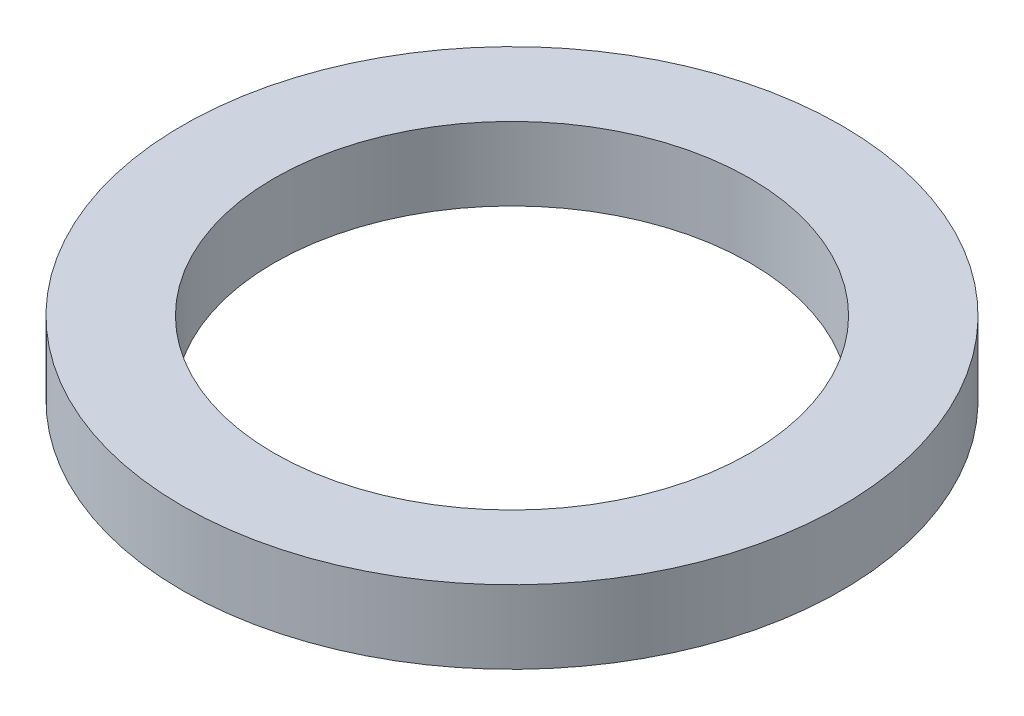
ISO-10303-21;
HEADER;
FILE_DESCRIPTION(('STEP AP214'),'2;1');
FILE_NAME('part.step','',(''),(''),'','','');
FILE_SCHEMA(('AUTOMOTIVE_DESIGN { 1 0 10303 214 1 1 1 1 }'));
ENDSEC;
DATA;
#1=APPLICATION_CONTEXT('core data for automotive mechanical design processes');
#2=APPLICATION_PROTOCOL_DEFINITION('international standard','automotive_design',2000,#1);
#3=PRODUCT_CONTEXT('',#1,'mechanical');
#4=PRODUCT('Part','Part','',(#3));
#5=PRODUCT_RELATED_PRODUCT_CATEGORY('part','',(#4));
#6=PRODUCT_DEFINITION_FORMATION('','',#4);
#7=PRODUCT_DEFINITION_CONTEXT('part definition',#1,'design');
#8=PRODUCT_DEFINITION('design','',#6,#7);
#9=PRODUCT_DEFINITION_SHAPE('','',#8);
#10=(LENGTH_UNIT() NAMED_UNIT(*) SI_UNIT(.MILLI.,.METRE.));
#11=(NAMED_UNIT(*) PLANE_ANGLE_UNIT() SI_UNIT($,.RADIAN.));
#12=(NAMED_UNIT(*) SI_UNIT($,.STERADIAN.) SOLID_ANGLE_UNIT());
#13=UNCERTAINTY_MEASURE_WITH_UNIT(LENGTH_MEASURE(1.E-05),#10,'distance_accuracy_value','');
#14=(GEOMETRIC_REPRESENTATION_CONTEXT(3) GLOBAL_UNCERTAINTY_ASSIGNED_CONTEXT((#13)) GLOBAL_UNIT_ASSIGNED_CONTEXT((#10,
#11,#12)) REPRESENTATION_CONTEXT('',''));
#15=CARTESIAN_POINT('',(0.,0.,0.));
#16=DIRECTION('',(0.,0.,1.));
#17=DIRECTION('',(1.,0.,0.));
#18=AXIS2_PLACEMENT_3D('',#15,#16,#17);
#19=CARTESIAN_POINT('',(0.,10.,0.));
#20=DIRECTION('',(0.,-1.,0.));
#21=DIRECTION('',(0.,0.,-1.));
#22=AXIS2_PLACEMENT_3D('',#19,#20,#21);
#23=CYLINDRICAL_SURFACE('',#22,45.);
#24=CARTESIAN_POINT('',(0.,10.,0.));
#25=DIRECTION('',(0.,1.,0.));
#26=DIRECTION('',(0.,0.,1.));
#27=AXIS2_PLACEMENT_3D('',#24,#25,#26);
#28=CIRCLE('',#27,45.);
#29=CARTESIAN_POINT('',(0.,10.,45.));
#30=VERTEX_POINT('',#29);
#31=EDGE_CURVE('E10',#30,#30,#28,.T.);
#32=ORIENTED_EDGE('',*,*,#31,.F.);
#33=EDGE_LOOP('',(#32));
#34=FACE_BOUND('',#33,.T.);
#35=CARTESIAN_POINT('',(0.,0.,0.));
#36=DIRECTION('',(0.,1.,0.));
#37=DIRECTION('',(0.,0.,1.));
#38=AXIS2_PLACEMENT_3D('',#35,#36,#37);
#39=CIRCLE('',#38,45.);
#40=CARTESIAN_POINT('',(0.,0.,45.));
#41=VERTEX_POINT('',#40);
#42=EDGE_CURVE('E37',#41,#41,#39,.T.);
#43=ORIENTED_EDGE('',*,*,#42,.T.);
#44=EDGE_LOOP('',(#43));
#45=FACE_BOUND('',#44,.T.);
#46=ADVANCED_FACE('F40',(#34,#45),#23,.T.);
#47=CARTESIAN_POINT('',(0.,10.,0.));
#48=DIRECTION('',(0.,1.,0.));
#49=DIRECTION('',(0.,0.,1.));
#50=AXIS2_PLACEMENT_3D('',#47,#48,#49);
#51=PLANE('',#50);
#52=CARTESIAN_POINT('',(0.,10.,0.));
#53=DIRECTION('',(0.,1.,0.));
#54=DIRECTION('',(0.,0.,1.));
#55=AXIS2_PLACEMENT_3D('',#52,#53,#54);
#56=CIRCLE('',#55,32.5);
#57=CARTESIAN_POINT('',(0.,10.,32.5));
#58=VERTEX_POINT('',#57);
#59=EDGE_CURVE('E50',#58,#58,#56,.T.);
#60=ORIENTED_EDGE('',*,*,#59,.F.);
#61=EDGE_LOOP('',(#60));
#62=FACE_BOUND('',#61,.T.);
#63=ORIENTED_EDGE('',*,*,#31,.T.);
#64=EDGE_LOOP('',(#63));
#65=FACE_BOUND('',#64,.T.);
#66=ADVANCED_FACE('F59',(#62,#65),#51,.T.);
#67=CARTESIAN_POINT('',(0.,0.,0.));
#68=DIRECTION('',(0.,1.,0.));
#69=DIRECTION('',(0.,0.,1.));
#70=AXIS2_PLACEMENT_3D('',#67,#68,#69);
#71=PLANE('',#70);
#72=CARTESIAN_POINT('',(0.,0.,0.));
#73=DIRECTION('',(0.,1.,0.));
#74=DIRECTION('',(0.,0.,1.));
#75=AXIS2_PLACEMENT_3D('',#72,#73,#74);
#76=CIRCLE('',#75,32.5);
#77=CARTESIAN_POINT('',(0.,0.,32.5));
#78=VERTEX_POINT('',#77);
#79=EDGE_CURVE('E47',#78,#78,#76,.T.);
#80=ORIENTED_EDGE('',*,*,#79,.T.);
#81=EDGE_LOOP('',(#80));
#82=FACE_BOUND('',#81,.T.);
#83=ORIENTED_EDGE('',*,*,#42,.F.);
#84=EDGE_LOOP('',(#83));
#85=FACE_BOUND('',#84,.T.);
#86=ADVANCED_FACE('F58',(#82,#85),#71,.F.);
#87=CARTESIAN_POINT('',(0.,10.,0.));
#88=DIRECTION('',(0.,-1.,0.));
#89=DIRECTION('',(0.,0.,-1.));
#90=AXIS2_PLACEMENT_3D('',#87,#88,#89);
#91=CYLINDRICAL_SURFACE('',#90,32.5);
#92=ORIENTED_EDGE('',*,*,#59,.T.);
#93=EDGE_LOOP('',(#92));
#94=FACE_BOUND('',#93,.T.);
#95=ORIENTED_EDGE('',*,*,#79,.F.);
#96=EDGE_LOOP('',(#95));
#97=FACE_BOUND('',#96,.T.);
#98=ADVANCED_FACE('F54',(#94,#97),#91,.F.);
#99=CLOSED_SHELL('',(#46,#66,#86,#98));
#100=MANIFOLD_SOLID_BREP('B2',#99);
#101=ADVANCED_BREP_SHAPE_REPRESENTATION('',(#18,#100),#14);
#102=SHAPE_DEFINITION_REPRESENTATION(#9,#101);
ENDSEC;
END-ISO-10303-21;
